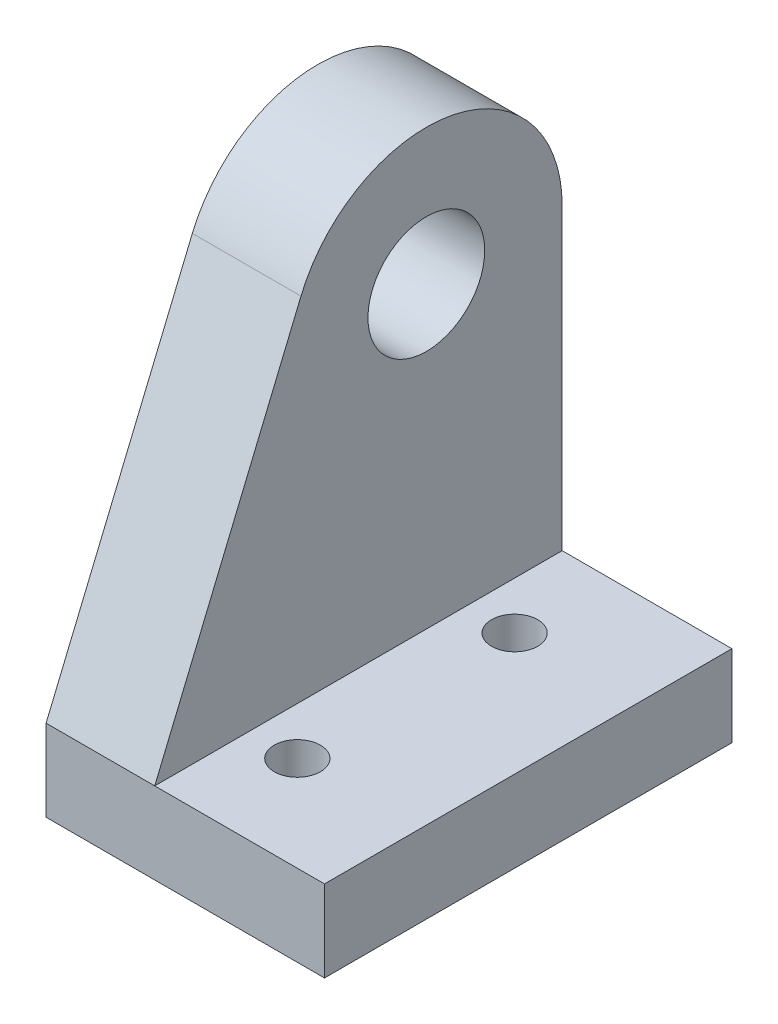
ISO-10303-21;
HEADER;
FILE_DESCRIPTION(('STEP AP214'),'2;1');
FILE_NAME('part.step','',(''),(''),'','','');
FILE_SCHEMA(('AUTOMOTIVE_DESIGN { 1 0 10303 214 1 1 1 1 }'));
ENDSEC;
DATA;
#1=APPLICATION_CONTEXT('core data for automotive mechanical design processes');
#2=APPLICATION_PROTOCOL_DEFINITION('international standard','automotive_design',2000,#1);
#3=PRODUCT_CONTEXT('',#1,'mechanical');
#4=PRODUCT('Part','Part','',(#3));
#5=PRODUCT_RELATED_PRODUCT_CATEGORY('part','',(#4));
#6=PRODUCT_DEFINITION_FORMATION('','',#4);
#7=PRODUCT_DEFINITION_CONTEXT('part definition',#1,'design');
#8=PRODUCT_DEFINITION('design','',#6,#7);
#9=PRODUCT_DEFINITION_SHAPE('','',#8);
#10=(LENGTH_UNIT() NAMED_UNIT(*) SI_UNIT(.MILLI.,.METRE.));
#11=(NAMED_UNIT(*) PLANE_ANGLE_UNIT() SI_UNIT($,.RADIAN.));
#12=(NAMED_UNIT(*) SI_UNIT($,.STERADIAN.) SOLID_ANGLE_UNIT());
#13=UNCERTAINTY_MEASURE_WITH_UNIT(LENGTH_MEASURE(1.E-05),#10,'distance_accuracy_value','');
#14=(GEOMETRIC_REPRESENTATION_CONTEXT(3) GLOBAL_UNCERTAINTY_ASSIGNED_CONTEXT((#13)) GLOBAL_UNIT_ASSIGNED_CONTEXT((#10,
#11,#12)) REPRESENTATION_CONTEXT('',''));
#15=CARTESIAN_POINT('',(0.,0.,0.));
#16=DIRECTION('',(0.,0.,1.));
#17=DIRECTION('',(1.,0.,0.));
#18=AXIS2_PLACEMENT_3D('',#15,#16,#17);
#19=CARTESIAN_POINT('',(0.,0.,30.));
#20=DIRECTION('',(-1.,0.,0.));
#21=DIRECTION('',(0.,-1.,0.));
#22=AXIS2_PLACEMENT_3D('',#19,#20,#21);
#23=PLANE('',#22);
#24=DIRECTION('',(0.,1.,0.));
#25=VECTOR('',#24,1.);
#26=CARTESIAN_POINT('',(0.,0.,0.));
#27=LINE('',#26,#25);
#28=CARTESIAN_POINT('',(0.,-6.,0.));
#29=VERTEX_POINT('',#28);
#30=CARTESIAN_POINT('',(0.,0.,0.));
#31=VERTEX_POINT('',#30);
#32=EDGE_CURVE('E151',#29,#31,#27,.T.);
#33=ORIENTED_EDGE('',*,*,#32,.T.);
#34=DIRECTION('',(0.,0.,-1.));
#35=VECTOR('',#34,1.);
#36=CARTESIAN_POINT('',(0.,0.,30.));
#37=LINE('',#36,#35);
#38=CARTESIAN_POINT('',(0.,0.,30.));
#39=VERTEX_POINT('',#38);
#40=EDGE_CURVE('E121',#39,#31,#37,.T.);
#41=ORIENTED_EDGE('',*,*,#40,.F.);
#42=DIRECTION('',(0.,1.,0.));
#43=VECTOR('',#42,1.);
#44=CARTESIAN_POINT('',(0.,0.,30.));
#45=LINE('',#44,#43);
#46=CARTESIAN_POINT('',(0.,-6.,30.));
#47=VERTEX_POINT('',#46);
#48=EDGE_CURVE('E134',#47,#39,#45,.T.);
#49=ORIENTED_EDGE('',*,*,#48,.F.);
#50=DIRECTION('',(0.,0.,-1.));
#51=VECTOR('',#50,1.);
#52=CARTESIAN_POINT('',(0.,-6.,30.));
#53=LINE('',#52,#51);
#54=EDGE_CURVE('E140',#47,#29,#53,.T.);
#55=ORIENTED_EDGE('',*,*,#54,.T.);
#56=EDGE_LOOP('',(#33,#41,#49,#55));
#57=FACE_BOUND('',#56,.T.);
#58=ADVANCED_FACE('F48',(#57),#23,.F.);
#59=CARTESIAN_POINT('',(0.,0.,30.));
#60=DIRECTION('',(0.,-1.,0.));
#61=DIRECTION('',(0.,0.,-1.));
#62=AXIS2_PLACEMENT_3D('',#59,#60,#61);
#63=PLANE('',#62);
#64=CARTESIAN_POINT('',(-9.,0.,23.));
#65=DIRECTION('',(0.,-1.,0.));
#66=DIRECTION('',(0.,0.,-1.));
#67=AXIS2_PLACEMENT_3D('',#64,#65,#66);
#68=CIRCLE('',#67,1.7);
#69=CARTESIAN_POINT('',(-9.,0.,21.3));
#70=VERTEX_POINT('',#69);
#71=EDGE_CURVE('E171',#70,#70,#68,.F.);
#72=ORIENTED_EDGE('',*,*,#71,.F.);
#73=EDGE_LOOP('',(#72));
#74=FACE_BOUND('',#73,.T.);
#75=CARTESIAN_POINT('',(-9.,0.,7.));
#76=DIRECTION('',(0.,-1.,0.));
#77=DIRECTION('',(0.,0.,-1.));
#78=AXIS2_PLACEMENT_3D('',#75,#76,#77);
#79=CIRCLE('',#78,1.7);
#80=CARTESIAN_POINT('',(-9.,0.,5.3));
#81=VERTEX_POINT('',#80);
#82=EDGE_CURVE('E172',#81,#81,#79,.F.);
#83=ORIENTED_EDGE('',*,*,#82,.F.);
#84=EDGE_LOOP('',(#83));
#85=FACE_BOUND('',#84,.T.);
#86=DIRECTION('',(-1.,0.,0.));
#87=VECTOR('',#86,1.);
#88=CARTESIAN_POINT('',(0.,0.,0.));
#89=LINE('',#88,#87);
#90=CARTESIAN_POINT('',(-12.5,0.,0.));
#91=VERTEX_POINT('',#90);
#92=EDGE_CURVE('E136',#31,#91,#89,.T.);
#93=ORIENTED_EDGE('',*,*,#92,.T.);
#94=DIRECTION('',(0.,0.,-1.));
#95=VECTOR('',#94,1.);
#96=CARTESIAN_POINT('',(-12.5,0.,30.));
#97=LINE('',#96,#95);
#98=CARTESIAN_POINT('',(-12.5,0.,30.));
#99=VERTEX_POINT('',#98);
#100=EDGE_CURVE('E144',#99,#91,#97,.T.);
#101=ORIENTED_EDGE('',*,*,#100,.F.);
#102=DIRECTION('',(-1.,0.,0.));
#103=VECTOR('',#102,1.);
#104=CARTESIAN_POINT('',(0.,0.,30.));
#105=LINE('',#104,#103);
#106=EDGE_CURVE('E98',#39,#99,#105,.T.);
#107=ORIENTED_EDGE('',*,*,#106,.F.);
#108=ORIENTED_EDGE('',*,*,#40,.T.);
#109=EDGE_LOOP('',(#93,#101,#107,#108));
#110=FACE_BOUND('',#109,.T.);
#111=ADVANCED_FACE('F148',(#74,#85,#110),#63,.F.);
#112=CARTESIAN_POINT('',(-12.5,0.,30.));
#113=DIRECTION('',(-1.,0.,0.));
#114=DIRECTION('',(0.,-1.,0.));
#115=AXIS2_PLACEMENT_3D('',#112,#113,#114);
#116=PLANE('',#115);
#117=CARTESIAN_POINT('',(-12.5,22.,10.));
#118=DIRECTION('',(-1.,0.,0.));
#119=DIRECTION('',(0.,-1.,0.));
#120=AXIS2_PLACEMENT_3D('',#117,#118,#119);
#121=CIRCLE('',#120,4.3);
#122=CARTESIAN_POINT('',(-12.5,17.7,10.));
#123=VERTEX_POINT('',#122);
#124=EDGE_CURVE('E152',#123,#123,#121,.T.);
#125=ORIENTED_EDGE('',*,*,#124,.T.);
#126=EDGE_LOOP('',(#125));
#127=FACE_BOUND('',#126,.T.);
#128=CARTESIAN_POINT('',(-12.5,22.,10.));
#129=DIRECTION('',(-1.,0.,0.));
#130=DIRECTION('',(0.,-1.,0.));
#131=AXIS2_PLACEMENT_3D('',#128,#129,#130);
#132=CIRCLE('',#131,10.);
#133=CARTESIAN_POINT('',(-12.5,22.,0.));
#134=VERTEX_POINT('',#133);
#135=CARTESIAN_POINT('',(-12.5,25.8461538461538,19.2307692307692));
#136=VERTEX_POINT('',#135);
#137=EDGE_CURVE('E118',#134,#136,#132,.F.);
#138=ORIENTED_EDGE('',*,*,#137,.T.);
#139=DIRECTION('',(0.,-0.923076923076923,0.384615384615384));
#140=VECTOR('',#139,1.);
#141=CARTESIAN_POINT('',(-12.5,0.,30.));
#142=LINE('',#141,#140);
#143=EDGE_CURVE('E155',#136,#99,#142,.T.);
#144=ORIENTED_EDGE('',*,*,#143,.T.);
#145=ORIENTED_EDGE('',*,*,#100,.T.);
#146=DIRECTION('',(0.,1.,0.));
#147=VECTOR('',#146,1.);
#148=CARTESIAN_POINT('',(-12.5,0.,0.));
#149=LINE('',#148,#147);
#150=EDGE_CURVE('E62',#91,#134,#149,.T.);
#151=ORIENTED_EDGE('',*,*,#150,.T.);
#152=EDGE_LOOP('',(#138,#144,#145,#151));
#153=FACE_BOUND('',#152,.T.);
#154=ADVANCED_FACE('F202',(#127,#153),#116,.F.);
#155=CARTESIAN_POINT('',(-20.5,32.,30.));
#156=DIRECTION('',(1.,0.,0.));
#157=DIRECTION('',(0.,1.,0.));
#158=AXIS2_PLACEMENT_3D('',#155,#156,#157);
#159=PLANE('',#158);
#160=CARTESIAN_POINT('',(-20.5,22.,10.));
#161=DIRECTION('',(-1.,0.,0.));
#162=DIRECTION('',(0.,-1.,0.));
#163=AXIS2_PLACEMENT_3D('',#160,#161,#162);
#164=CIRCLE('',#163,4.3);
#165=CARTESIAN_POINT('',(-20.5,17.7,10.));
#166=VERTEX_POINT('',#165);
#167=EDGE_CURVE('E129',#166,#166,#164,.T.);
#168=ORIENTED_EDGE('',*,*,#167,.F.);
#169=EDGE_LOOP('',(#168));
#170=FACE_BOUND('',#169,.T.);
#171=DIRECTION('',(0.,-1.,0.));
#172=VECTOR('',#171,1.);
#173=CARTESIAN_POINT('',(-20.5,32.,30.));
#174=LINE('',#173,#172);
#175=CARTESIAN_POINT('',(-20.5,0.,30.));
#176=VERTEX_POINT('',#175);
#177=CARTESIAN_POINT('',(-20.5,-6.,30.));
#178=VERTEX_POINT('',#177);
#179=EDGE_CURVE('E159',#176,#178,#174,.T.);
#180=ORIENTED_EDGE('',*,*,#179,.F.);
#181=DIRECTION('',(0.,-0.923076923076923,0.384615384615384));
#182=VECTOR('',#181,1.);
#183=CARTESIAN_POINT('',(-20.5,0.,30.));
#184=LINE('',#183,#182);
#185=CARTESIAN_POINT('',(-20.5,25.8461538461538,19.2307692307692));
#186=VERTEX_POINT('',#185);
#187=EDGE_CURVE('E128',#186,#176,#184,.T.);
#188=ORIENTED_EDGE('',*,*,#187,.F.);
#189=CARTESIAN_POINT('',(-20.5,22.,10.));
#190=DIRECTION('',(1.,0.,0.));
#191=DIRECTION('',(0.,-1.,0.));
#192=AXIS2_PLACEMENT_3D('',#189,#190,#191);
#193=CIRCLE('',#192,10.);
#194=CARTESIAN_POINT('',(-20.5,22.,0.));
#195=VERTEX_POINT('',#194);
#196=EDGE_CURVE('E116',#195,#186,#193,.T.);
#197=ORIENTED_EDGE('',*,*,#196,.F.);
#198=DIRECTION('',(0.,-1.,0.));
#199=VECTOR('',#198,1.);
#200=CARTESIAN_POINT('',(-20.5,32.,0.));
#201=LINE('',#200,#199);
#202=CARTESIAN_POINT('',(-20.5,-6.,0.));
#203=VERTEX_POINT('',#202);
#204=EDGE_CURVE('E127',#195,#203,#201,.T.);
#205=ORIENTED_EDGE('',*,*,#204,.T.);
#206=DIRECTION('',(0.,0.,-1.));
#207=VECTOR('',#206,1.);
#208=CARTESIAN_POINT('',(-20.5,-6.,30.));
#209=LINE('',#208,#207);
#210=EDGE_CURVE('E142',#178,#203,#209,.T.);
#211=ORIENTED_EDGE('',*,*,#210,.F.);
#212=EDGE_LOOP('',(#180,#188,#197,#205,#211));
#213=FACE_BOUND('',#212,.T.);
#214=ADVANCED_FACE('F125',(#170,#213),#159,.F.);
#215=CARTESIAN_POINT('',(-20.5,-6.,30.));
#216=DIRECTION('',(0.,1.,0.));
#217=DIRECTION('',(0.,0.,1.));
#218=AXIS2_PLACEMENT_3D('',#215,#216,#217);
#219=PLANE('',#218);
#220=CARTESIAN_POINT('',(-9.,-6.,23.));
#221=DIRECTION('',(0.,-1.,0.));
#222=DIRECTION('',(0.,0.,-1.));
#223=AXIS2_PLACEMENT_3D('',#220,#221,#222);
#224=CIRCLE('',#223,1.7);
#225=CARTESIAN_POINT('',(-9.,-6.,21.3));
#226=VERTEX_POINT('',#225);
#227=EDGE_CURVE('E175',#226,#226,#224,.T.);
#228=ORIENTED_EDGE('',*,*,#227,.F.);
#229=EDGE_LOOP('',(#228));
#230=FACE_BOUND('',#229,.T.);
#231=CARTESIAN_POINT('',(-9.,-6.,7.));
#232=DIRECTION('',(0.,-1.,0.));
#233=DIRECTION('',(0.,0.,-1.));
#234=AXIS2_PLACEMENT_3D('',#231,#232,#233);
#235=CIRCLE('',#234,1.7);
#236=CARTESIAN_POINT('',(-9.,-6.,5.3));
#237=VERTEX_POINT('',#236);
#238=EDGE_CURVE('E176',#237,#237,#235,.T.);
#239=ORIENTED_EDGE('',*,*,#238,.F.);
#240=EDGE_LOOP('',(#239));
#241=FACE_BOUND('',#240,.T.);
#242=DIRECTION('',(1.,0.,0.));
#243=VECTOR('',#242,1.);
#244=CARTESIAN_POINT('',(-20.5,-6.,0.));
#245=LINE('',#244,#243);
#246=EDGE_CURVE('E91',#203,#29,#245,.T.);
#247=ORIENTED_EDGE('',*,*,#246,.T.);
#248=ORIENTED_EDGE('',*,*,#54,.F.);
#249=DIRECTION('',(1.,0.,0.));
#250=VECTOR('',#249,1.);
#251=CARTESIAN_POINT('',(-20.5,-6.,30.));
#252=LINE('',#251,#250);
#253=EDGE_CURVE('E71',#178,#47,#252,.T.);
#254=ORIENTED_EDGE('',*,*,#253,.F.);
#255=ORIENTED_EDGE('',*,*,#210,.T.);
#256=EDGE_LOOP('',(#247,#248,#254,#255));
#257=FACE_BOUND('',#256,.T.);
#258=ADVANCED_FACE('F187',(#230,#241,#257),#219,.F.);
#259=CARTESIAN_POINT('',(0.,0.,30.));
#260=DIRECTION('',(0.,0.,1.));
#261=DIRECTION('',(1.,0.,0.));
#262=AXIS2_PLACEMENT_3D('',#259,#260,#261);
#263=PLANE('',#262);
#264=DIRECTION('',(1.,0.,0.));
#265=VECTOR('',#264,1.);
#266=CARTESIAN_POINT('',(0.,0.,30.));
#267=LINE('',#266,#265);
#268=EDGE_CURVE('E13',#176,#99,#267,.T.);
#269=ORIENTED_EDGE('',*,*,#268,.F.);
#270=ORIENTED_EDGE('',*,*,#179,.T.);
#271=ORIENTED_EDGE('',*,*,#253,.T.);
#272=ORIENTED_EDGE('',*,*,#48,.T.);
#273=ORIENTED_EDGE('',*,*,#106,.T.);
#274=EDGE_LOOP('',(#269,#270,#271,#272,#273));
#275=FACE_BOUND('',#274,.T.);
#276=ADVANCED_FACE('F190',(#275),#263,.T.);
#277=CARTESIAN_POINT('',(0.,0.,0.));
#278=DIRECTION('',(0.,0.,1.));
#279=DIRECTION('',(1.,0.,0.));
#280=AXIS2_PLACEMENT_3D('',#277,#278,#279);
#281=PLANE('',#280);
#282=ORIENTED_EDGE('',*,*,#246,.F.);
#283=ORIENTED_EDGE('',*,*,#204,.F.);
#284=DIRECTION('',(-1.,0.,0.));
#285=VECTOR('',#284,1.);
#286=CARTESIAN_POINT('',(0.,22.,0.));
#287=LINE('',#286,#285);
#288=EDGE_CURVE('E55',#195,#134,#287,.F.);
#289=ORIENTED_EDGE('',*,*,#288,.T.);
#290=ORIENTED_EDGE('',*,*,#150,.F.);
#291=ORIENTED_EDGE('',*,*,#92,.F.);
#292=ORIENTED_EDGE('',*,*,#32,.F.);
#293=EDGE_LOOP('',(#282,#283,#289,#290,#291,#292));
#294=FACE_BOUND('',#293,.T.);
#295=ADVANCED_FACE('F131',(#294),#281,.F.);
#296=CARTESIAN_POINT('',(0.,0.,30.));
#297=DIRECTION('',(0.,-0.384615384615384,-0.923076923076923));
#298=DIRECTION('',(0.,0.923076923076923,-0.384615384615384));
#299=AXIS2_PLACEMENT_3D('',#296,#297,#298);
#300=PLANE('',#299);
#301=DIRECTION('',(-1.,0.,0.));
#302=VECTOR('',#301,1.);
#303=CARTESIAN_POINT('',(0.,25.8461538461538,19.2307692307692));
#304=LINE('',#303,#302);
#305=EDGE_CURVE('E166',#136,#186,#304,.T.);
#306=ORIENTED_EDGE('',*,*,#305,.T.);
#307=ORIENTED_EDGE('',*,*,#187,.T.);
#308=ORIENTED_EDGE('',*,*,#268,.T.);
#309=ORIENTED_EDGE('',*,*,#143,.F.);
#310=EDGE_LOOP('',(#306,#307,#308,#309));
#311=FACE_BOUND('',#310,.T.);
#312=ADVANCED_FACE('F217',(#311),#300,.F.);
#313=CARTESIAN_POINT('',(0.,22.,10.));
#314=DIRECTION('',(-1.,0.,0.));
#315=DIRECTION('',(0.,-1.,0.));
#316=AXIS2_PLACEMENT_3D('',#313,#314,#315);
#317=CYLINDRICAL_SURFACE('',#316,10.);
#318=ORIENTED_EDGE('',*,*,#288,.F.);
#319=ORIENTED_EDGE('',*,*,#196,.T.);
#320=ORIENTED_EDGE('',*,*,#305,.F.);
#321=ORIENTED_EDGE('',*,*,#137,.F.);
#322=EDGE_LOOP('',(#318,#319,#320,#321));
#323=FACE_BOUND('',#322,.T.);
#324=ADVANCED_FACE('F114',(#323),#317,.T.);
#325=CARTESIAN_POINT('',(0.,22.,10.));
#326=DIRECTION('',(-1.,0.,0.));
#327=DIRECTION('',(0.,-1.,0.));
#328=AXIS2_PLACEMENT_3D('',#325,#326,#327);
#329=CYLINDRICAL_SURFACE('',#328,4.3);
#330=ORIENTED_EDGE('',*,*,#167,.T.);
#331=EDGE_LOOP('',(#330));
#332=FACE_BOUND('',#331,.T.);
#333=ORIENTED_EDGE('',*,*,#124,.F.);
#334=EDGE_LOOP('',(#333));
#335=FACE_BOUND('',#334,.T.);
#336=ADVANCED_FACE('F197',(#332,#335),#329,.F.);
#337=CARTESIAN_POINT('',(-9.,32.001,7.));
#338=DIRECTION('',(0.,-1.,0.));
#339=DIRECTION('',(0.,0.,-1.));
#340=AXIS2_PLACEMENT_3D('',#337,#338,#339);
#341=CYLINDRICAL_SURFACE('',#340,1.7);
#342=ORIENTED_EDGE('',*,*,#238,.T.);
#343=EDGE_LOOP('',(#342));
#344=FACE_BOUND('',#343,.T.);
#345=ORIENTED_EDGE('',*,*,#82,.T.);
#346=EDGE_LOOP('',(#345));
#347=FACE_BOUND('',#346,.T.);
#348=ADVANCED_FACE('F194',(#344,#347),#341,.F.);
#349=CARTESIAN_POINT('',(-9.,32.001,23.));
#350=DIRECTION('',(0.,-1.,0.));
#351=DIRECTION('',(0.,0.,-1.));
#352=AXIS2_PLACEMENT_3D('',#349,#350,#351);
#353=CYLINDRICAL_SURFACE('',#352,1.7);
#354=ORIENTED_EDGE('',*,*,#227,.T.);
#355=EDGE_LOOP('',(#354));
#356=FACE_BOUND('',#355,.T.);
#357=ORIENTED_EDGE('',*,*,#71,.T.);
#358=EDGE_LOOP('',(#357));
#359=FACE_BOUND('',#358,.T.);
#360=ADVANCED_FACE('F184',(#356,#359),#353,.F.);
#361=CLOSED_SHELL('',(#58,#111,#154,#214,#258,#276,#295,#312,#324,#336,#348,#360));
#362=MANIFOLD_SOLID_BREP('B2',#361);
#363=ADVANCED_BREP_SHAPE_REPRESENTATION('',(#18,#362),#14);
#364=SHAPE_DEFINITION_REPRESENTATION(#9,#363);
ENDSEC;
END-ISO-10303-21;
